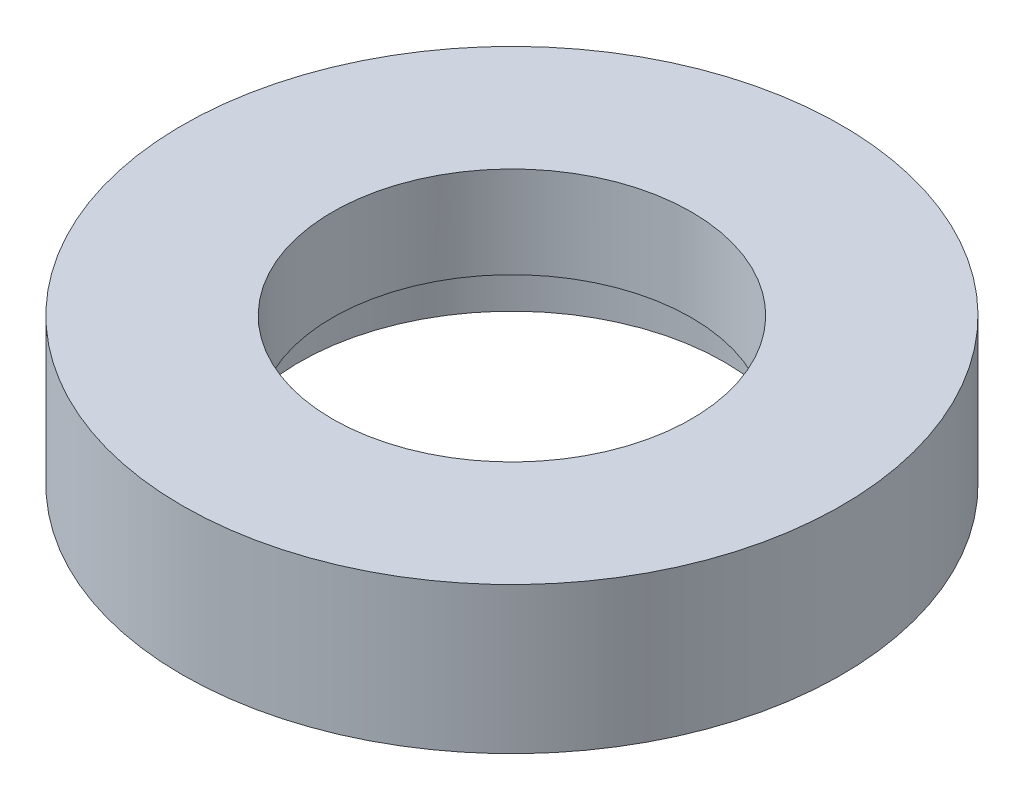
ISO-10303-21;
HEADER;
FILE_DESCRIPTION(('STEP AP214'),'2;1');
FILE_NAME('part.step','',(''),(''),'','','');
FILE_SCHEMA(('AUTOMOTIVE_DESIGN { 1 0 10303 214 1 1 1 1 }'));
ENDSEC;
DATA;
#1=APPLICATION_CONTEXT('core data for automotive mechanical design processes');
#2=APPLICATION_PROTOCOL_DEFINITION('international standard','automotive_design',2000,#1);
#3=PRODUCT_CONTEXT('',#1,'mechanical');
#4=PRODUCT('Part','Part','',(#3));
#5=PRODUCT_RELATED_PRODUCT_CATEGORY('part','',(#4));
#6=PRODUCT_DEFINITION_FORMATION('','',#4);
#7=PRODUCT_DEFINITION_CONTEXT('part definition',#1,'design');
#8=PRODUCT_DEFINITION('design','',#6,#7);
#9=PRODUCT_DEFINITION_SHAPE('','',#8);
#10=(LENGTH_UNIT() NAMED_UNIT(*) SI_UNIT(.MILLI.,.METRE.));
#11=(NAMED_UNIT(*) PLANE_ANGLE_UNIT() SI_UNIT($,.RADIAN.));
#12=(NAMED_UNIT(*) SI_UNIT($,.STERADIAN.) SOLID_ANGLE_UNIT());
#13=UNCERTAINTY_MEASURE_WITH_UNIT(LENGTH_MEASURE(1.E-05),#10,'distance_accuracy_value','');
#14=(GEOMETRIC_REPRESENTATION_CONTEXT(3) GLOBAL_UNCERTAINTY_ASSIGNED_CONTEXT((#13)) GLOBAL_UNIT_ASSIGNED_CONTEXT((#10,
#11,#12)) REPRESENTATION_CONTEXT('',''));
#15=CARTESIAN_POINT('',(0.,0.,0.));
#16=DIRECTION('',(0.,0.,1.));
#17=DIRECTION('',(1.,0.,0.));
#18=AXIS2_PLACEMENT_3D('',#15,#16,#17);
#19=CARTESIAN_POINT('',(0.,2.,0.));
#20=DIRECTION('',(0.,-1.,0.));
#21=DIRECTION('',(0.,0.,-1.));
#22=AXIS2_PLACEMENT_3D('',#19,#20,#21);
#23=CYLINDRICAL_SURFACE('',#22,2.45);
#24=CARTESIAN_POINT('',(0.,2.,0.));
#25=DIRECTION('',(0.,1.,0.));
#26=DIRECTION('',(0.,0.,1.));
#27=AXIS2_PLACEMENT_3D('',#24,#25,#26);
#28=CIRCLE('',#27,2.45);
#29=CARTESIAN_POINT('',(0.,2.,2.45));
#30=VERTEX_POINT('',#29);
#31=EDGE_CURVE('E58',#30,#30,#28,.T.);
#32=ORIENTED_EDGE('',*,*,#31,.T.);
#33=EDGE_LOOP('',(#32));
#34=FACE_BOUND('',#33,.T.);
#35=CARTESIAN_POINT('',(0.,0.75,0.));
#36=DIRECTION('',(0.,-1.,0.));
#37=DIRECTION('',(0.,0.,-1.));
#38=AXIS2_PLACEMENT_3D('',#35,#36,#37);
#39=CIRCLE('',#38,2.45);
#40=CARTESIAN_POINT('',(0.,0.75,-2.45));
#41=VERTEX_POINT('',#40);
#42=EDGE_CURVE('E47',#41,#41,#39,.T.);
#43=ORIENTED_EDGE('',*,*,#42,.T.);
#44=EDGE_LOOP('',(#43));
#45=FACE_BOUND('',#44,.T.);
#46=ADVANCED_FACE('F43',(#34,#45),#23,.F.);
#47=CARTESIAN_POINT('',(0.,2.,0.));
#48=DIRECTION('',(0.,1.,0.));
#49=DIRECTION('',(0.,0.,1.));
#50=AXIS2_PLACEMENT_3D('',#47,#48,#49);
#51=PLANE('',#50);
#52=CARTESIAN_POINT('',(0.,2.,0.));
#53=DIRECTION('',(0.,1.,0.));
#54=DIRECTION('',(0.,0.,1.));
#55=AXIS2_PLACEMENT_3D('',#52,#53,#54);
#56=CIRCLE('',#55,4.5);
#57=CARTESIAN_POINT('',(0.,2.,4.5));
#58=VERTEX_POINT('',#57);
#59=EDGE_CURVE('E10',#58,#58,#56,.T.);
#60=ORIENTED_EDGE('',*,*,#59,.T.);
#61=EDGE_LOOP('',(#60));
#62=FACE_BOUND('',#61,.T.);
#63=ORIENTED_EDGE('',*,*,#31,.F.);
#64=EDGE_LOOP('',(#63));
#65=FACE_BOUND('',#64,.T.);
#66=ADVANCED_FACE('F87',(#62,#65),#51,.T.);
#67=CARTESIAN_POINT('',(0.,0.,0.));
#68=DIRECTION('',(0.,1.,0.));
#69=DIRECTION('',(0.,0.,1.));
#70=AXIS2_PLACEMENT_3D('',#67,#68,#69);
#71=PLANE('',#70);
#72=CARTESIAN_POINT('',(0.,0.,0.));
#73=DIRECTION('',(0.,-1.,0.));
#74=DIRECTION('',(0.,0.,-1.));
#75=AXIS2_PLACEMENT_3D('',#72,#73,#74);
#76=CIRCLE('',#75,2.9);
#77=CARTESIAN_POINT('',(0.,0.,-2.9));
#78=VERTEX_POINT('',#77);
#79=EDGE_CURVE('E63',#78,#78,#76,.T.);
#80=ORIENTED_EDGE('',*,*,#79,.F.);
#81=EDGE_LOOP('',(#80));
#82=FACE_BOUND('',#81,.T.);
#83=CARTESIAN_POINT('',(0.,0.,0.));
#84=DIRECTION('',(0.,1.,0.));
#85=DIRECTION('',(0.,0.,1.));
#86=AXIS2_PLACEMENT_3D('',#83,#84,#85);
#87=CIRCLE('',#86,4.5);
#88=CARTESIAN_POINT('',(0.,0.,4.5));
#89=VERTEX_POINT('',#88);
#90=EDGE_CURVE('E52',#89,#89,#87,.T.);
#91=ORIENTED_EDGE('',*,*,#90,.F.);
#92=EDGE_LOOP('',(#91));
#93=FACE_BOUND('',#92,.T.);
#94=ADVANCED_FACE('F95',(#82,#93),#71,.F.);
#95=CARTESIAN_POINT('',(0.,2.,0.));
#96=DIRECTION('',(0.,-1.,0.));
#97=DIRECTION('',(0.,0.,-1.));
#98=AXIS2_PLACEMENT_3D('',#95,#96,#97);
#99=CYLINDRICAL_SURFACE('',#98,4.5);
#100=ORIENTED_EDGE('',*,*,#59,.F.);
#101=EDGE_LOOP('',(#100));
#102=FACE_BOUND('',#101,.T.);
#103=ORIENTED_EDGE('',*,*,#90,.T.);
#104=EDGE_LOOP('',(#103));
#105=FACE_BOUND('',#104,.T.);
#106=ADVANCED_FACE('F45',(#102,#105),#99,.T.);
#107=CARTESIAN_POINT('',(0.,0.75,0.));
#108=DIRECTION('',(0.,-1.,0.));
#109=DIRECTION('',(0.,0.,-1.));
#110=AXIS2_PLACEMENT_3D('',#107,#108,#109);
#111=CYLINDRICAL_SURFACE('',#110,2.9);
#112=CARTESIAN_POINT('',(0.,0.75,0.));
#113=DIRECTION('',(0.,-1.,0.));
#114=DIRECTION('',(0.,0.,-1.));
#115=AXIS2_PLACEMENT_3D('',#112,#113,#114);
#116=CIRCLE('',#115,2.9);
#117=CARTESIAN_POINT('',(0.,0.75,-2.9));
#118=VERTEX_POINT('',#117);
#119=EDGE_CURVE('E67',#118,#118,#116,.T.);
#120=ORIENTED_EDGE('',*,*,#119,.F.);
#121=EDGE_LOOP('',(#120));
#122=FACE_BOUND('',#121,.T.);
#123=ORIENTED_EDGE('',*,*,#79,.T.);
#124=EDGE_LOOP('',(#123));
#125=FACE_BOUND('',#124,.T.);
#126=ADVANCED_FACE('F79',(#122,#125),#111,.F.);
#127=CARTESIAN_POINT('',(0.,0.75,0.));
#128=DIRECTION('',(0.,-1.,0.));
#129=DIRECTION('',(0.,0.,-1.));
#130=AXIS2_PLACEMENT_3D('',#127,#128,#129);
#131=PLANE('',#130);
#132=ORIENTED_EDGE('',*,*,#42,.F.);
#133=EDGE_LOOP('',(#132));
#134=FACE_BOUND('',#133,.T.);
#135=ORIENTED_EDGE('',*,*,#119,.T.);
#136=EDGE_LOOP('',(#135));
#137=FACE_BOUND('',#136,.T.);
#138=ADVANCED_FACE('F77',(#134,#137),#131,.T.);
#139=CLOSED_SHELL('',(#46,#66,#94,#106,#126,#138));
#140=MANIFOLD_SOLID_BREP('B2',#139);
#141=ADVANCED_BREP_SHAPE_REPRESENTATION('',(#18,#140),#14);
#142=SHAPE_DEFINITION_REPRESENTATION(#9,#141);
ENDSEC;
END-ISO-10303-21;
